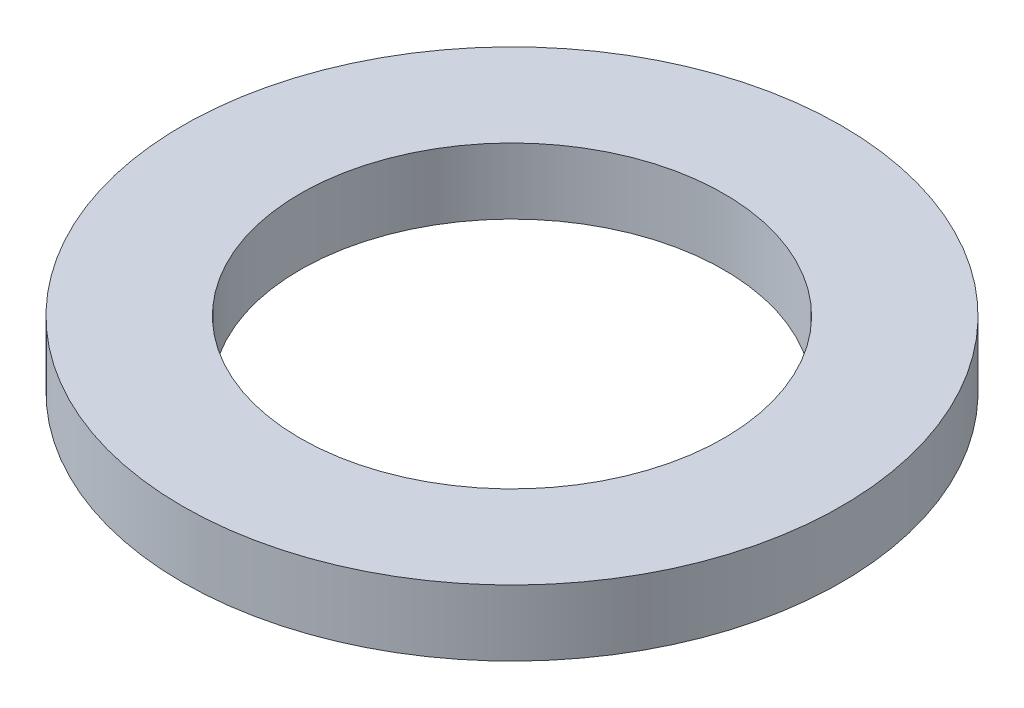
ISO-10303-21;
HEADER;
FILE_DESCRIPTION(('STEP AP214'),'2;1');
FILE_NAME('part.step','',(''),(''),'','','');
FILE_SCHEMA(('AUTOMOTIVE_DESIGN { 1 0 10303 214 1 1 1 1 }'));
ENDSEC;
DATA;
#1=APPLICATION_CONTEXT('core data for automotive mechanical design processes');
#2=APPLICATION_PROTOCOL_DEFINITION('international standard','automotive_design',2000,#1);
#3=PRODUCT_CONTEXT('',#1,'mechanical');
#4=PRODUCT('Part','Part','',(#3));
#5=PRODUCT_RELATED_PRODUCT_CATEGORY('part','',(#4));
#6=PRODUCT_DEFINITION_FORMATION('','',#4);
#7=PRODUCT_DEFINITION_CONTEXT('part definition',#1,'design');
#8=PRODUCT_DEFINITION('design','',#6,#7);
#9=PRODUCT_DEFINITION_SHAPE('','',#8);
#10=(LENGTH_UNIT() NAMED_UNIT(*) SI_UNIT(.MILLI.,.METRE.));
#11=(NAMED_UNIT(*) PLANE_ANGLE_UNIT() SI_UNIT($,.RADIAN.));
#12=(NAMED_UNIT(*) SI_UNIT($,.STERADIAN.) SOLID_ANGLE_UNIT());
#13=UNCERTAINTY_MEASURE_WITH_UNIT(LENGTH_MEASURE(1.E-05),#10,'distance_accuracy_value','');
#14=(GEOMETRIC_REPRESENTATION_CONTEXT(3) GLOBAL_UNCERTAINTY_ASSIGNED_CONTEXT((#13)) GLOBAL_UNIT_ASSIGNED_CONTEXT((#10,
#11,#12)) REPRESENTATION_CONTEXT('',''));
#15=CARTESIAN_POINT('',(0.,0.,0.));
#16=DIRECTION('',(0.,0.,1.));
#17=DIRECTION('',(1.,0.,0.));
#18=AXIS2_PLACEMENT_3D('',#15,#16,#17);
#19=CARTESIAN_POINT('',(0.,14.,0.));
#20=DIRECTION('',(0.,-1.,0.));
#21=DIRECTION('',(0.,0.,-1.));
#22=AXIS2_PLACEMENT_3D('',#19,#20,#21);
#23=CYLINDRICAL_SURFACE('',#22,70.);
#24=CARTESIAN_POINT('',(0.,14.,0.));
#25=DIRECTION('',(0.,1.,0.));
#26=DIRECTION('',(0.,0.,1.));
#27=AXIS2_PLACEMENT_3D('',#24,#25,#26);
#28=CIRCLE('',#27,70.);
#29=CARTESIAN_POINT('',(0.,14.,70.));
#30=VERTEX_POINT('',#29);
#31=EDGE_CURVE('E10',#30,#30,#28,.T.);
#32=ORIENTED_EDGE('',*,*,#31,.F.);
#33=EDGE_LOOP('',(#32));
#34=FACE_BOUND('',#33,.T.);
#35=CARTESIAN_POINT('',(0.,0.,0.));
#36=DIRECTION('',(0.,1.,0.));
#37=DIRECTION('',(0.,0.,1.));
#38=AXIS2_PLACEMENT_3D('',#35,#36,#37);
#39=CIRCLE('',#38,70.);
#40=CARTESIAN_POINT('',(0.,0.,70.));
#41=VERTEX_POINT('',#40);
#42=EDGE_CURVE('E37',#41,#41,#39,.T.);
#43=ORIENTED_EDGE('',*,*,#42,.T.);
#44=EDGE_LOOP('',(#43));
#45=FACE_BOUND('',#44,.T.);
#46=ADVANCED_FACE('F40',(#34,#45),#23,.T.);
#47=CARTESIAN_POINT('',(0.,14.,0.));
#48=DIRECTION('',(0.,1.,0.));
#49=DIRECTION('',(0.,0.,1.));
#50=AXIS2_PLACEMENT_3D('',#47,#48,#49);
#51=PLANE('',#50);
#52=CARTESIAN_POINT('',(0.,14.,0.));
#53=DIRECTION('',(0.,1.,0.));
#54=DIRECTION('',(0.,0.,1.));
#55=AXIS2_PLACEMENT_3D('',#52,#53,#54);
#56=CIRCLE('',#55,45.);
#57=CARTESIAN_POINT('',(0.,14.,45.));
#58=VERTEX_POINT('',#57);
#59=EDGE_CURVE('E50',#58,#58,#56,.T.);
#60=ORIENTED_EDGE('',*,*,#59,.F.);
#61=EDGE_LOOP('',(#60));
#62=FACE_BOUND('',#61,.T.);
#63=ORIENTED_EDGE('',*,*,#31,.T.);
#64=EDGE_LOOP('',(#63));
#65=FACE_BOUND('',#64,.T.);
#66=ADVANCED_FACE('F59',(#62,#65),#51,.T.);
#67=CARTESIAN_POINT('',(0.,0.,0.));
#68=DIRECTION('',(0.,1.,0.));
#69=DIRECTION('',(0.,0.,1.));
#70=AXIS2_PLACEMENT_3D('',#67,#68,#69);
#71=PLANE('',#70);
#72=CARTESIAN_POINT('',(0.,0.,0.));
#73=DIRECTION('',(0.,1.,0.));
#74=DIRECTION('',(0.,0.,1.));
#75=AXIS2_PLACEMENT_3D('',#72,#73,#74);
#76=CIRCLE('',#75,45.);
#77=CARTESIAN_POINT('',(0.,0.,45.));
#78=VERTEX_POINT('',#77);
#79=EDGE_CURVE('E47',#78,#78,#76,.T.);
#80=ORIENTED_EDGE('',*,*,#79,.T.);
#81=EDGE_LOOP('',(#80));
#82=FACE_BOUND('',#81,.T.);
#83=ORIENTED_EDGE('',*,*,#42,.F.);
#84=EDGE_LOOP('',(#83));
#85=FACE_BOUND('',#84,.T.);
#86=ADVANCED_FACE('F58',(#82,#85),#71,.F.);
#87=CARTESIAN_POINT('',(0.,14.,0.));
#88=DIRECTION('',(0.,-1.,0.));
#89=DIRECTION('',(0.,0.,-1.));
#90=AXIS2_PLACEMENT_3D('',#87,#88,#89);
#91=CYLINDRICAL_SURFACE('',#90,45.);
#92=ORIENTED_EDGE('',*,*,#59,.T.);
#93=EDGE_LOOP('',(#92));
#94=FACE_BOUND('',#93,.T.);
#95=ORIENTED_EDGE('',*,*,#79,.F.);
#96=EDGE_LOOP('',(#95));
#97=FACE_BOUND('',#96,.T.);
#98=ADVANCED_FACE('F54',(#94,#97),#91,.F.);
#99=CLOSED_SHELL('',(#46,#66,#86,#98));
#100=MANIFOLD_SOLID_BREP('B2',#99);
#101=ADVANCED_BREP_SHAPE_REPRESENTATION('',(#18,#100),#14);
#102=SHAPE_DEFINITION_REPRESENTATION(#9,#101);
ENDSEC;
END-ISO-10303-21;
